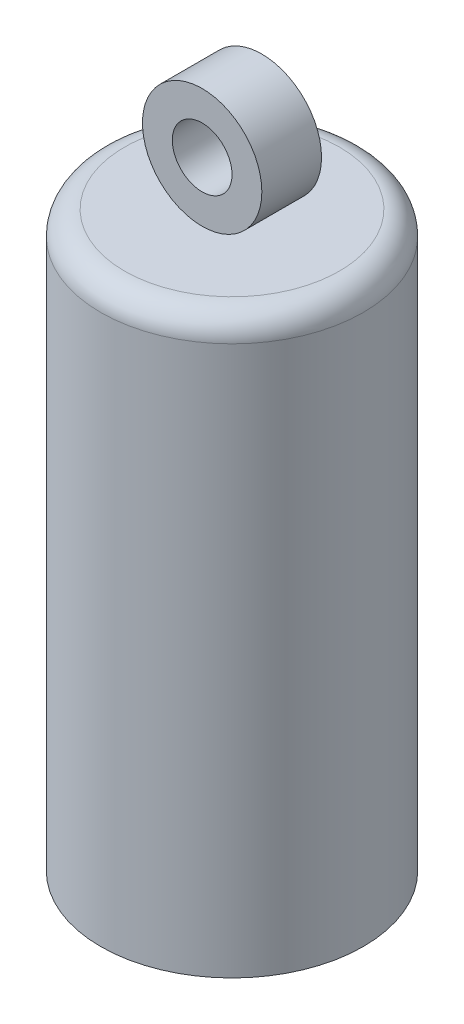
ISO-10303-21;
HEADER;
FILE_DESCRIPTION(('STEP AP214'),'2;1');
FILE_NAME('part.step','',(''),(''),'','','');
FILE_SCHEMA(('AUTOMOTIVE_DESIGN { 1 0 10303 214 1 1 1 1 }'));
ENDSEC;
DATA;
#1=APPLICATION_CONTEXT('core data for automotive mechanical design processes');
#2=APPLICATION_PROTOCOL_DEFINITION('international standard','automotive_design',2000,#1);
#3=PRODUCT_CONTEXT('',#1,'mechanical');
#4=PRODUCT('Part','Part','',(#3));
#5=PRODUCT_RELATED_PRODUCT_CATEGORY('part','',(#4));
#6=PRODUCT_DEFINITION_FORMATION('','',#4);
#7=PRODUCT_DEFINITION_CONTEXT('part definition',#1,'design');
#8=PRODUCT_DEFINITION('design','',#6,#7);
#9=PRODUCT_DEFINITION_SHAPE('','',#8);
#10=(LENGTH_UNIT() NAMED_UNIT(*) SI_UNIT(.MILLI.,.METRE.));
#11=(NAMED_UNIT(*) PLANE_ANGLE_UNIT() SI_UNIT($,.RADIAN.));
#12=(NAMED_UNIT(*) SI_UNIT($,.STERADIAN.) SOLID_ANGLE_UNIT());
#13=UNCERTAINTY_MEASURE_WITH_UNIT(LENGTH_MEASURE(1.E-05),#10,'distance_accuracy_value','');
#14=(GEOMETRIC_REPRESENTATION_CONTEXT(3) GLOBAL_UNCERTAINTY_ASSIGNED_CONTEXT((#13)) GLOBAL_UNIT_ASSIGNED_CONTEXT((#10,
#11,#12)) REPRESENTATION_CONTEXT('',''));
#15=CARTESIAN_POINT('',(0.,0.,0.));
#16=DIRECTION('',(0.,0.,1.));
#17=DIRECTION('',(1.,0.,0.));
#18=AXIS2_PLACEMENT_3D('',#15,#16,#17);
#19=CARTESIAN_POINT('',(0.,4.,1.25));
#20=DIRECTION('',(0.,0.,1.));
#21=DIRECTION('',(1.,0.,0.));
#22=AXIS2_PLACEMENT_3D('',#19,#20,#21);
#23=PLANE('',#22);
#24=CARTESIAN_POINT('',(0.,4.,1.25));
#25=DIRECTION('',(0.,0.,1.));
#26=DIRECTION('',(1.,0.,0.));
#27=AXIS2_PLACEMENT_3D('',#24,#25,#26);
#28=CIRCLE('',#27,2.5);
#29=CARTESIAN_POINT('',(2.5,4.,1.25));
#30=VERTEX_POINT('',#29);
#31=EDGE_CURVE('E11',#30,#30,#28,.T.);
#32=ORIENTED_EDGE('',*,*,#31,.T.);
#33=EDGE_LOOP('',(#32));
#34=FACE_BOUND('',#33,.T.);
#35=CARTESIAN_POINT('',(0.,4.,1.25));
#36=DIRECTION('',(0.,0.,1.));
#37=DIRECTION('',(1.,0.,0.));
#38=AXIS2_PLACEMENT_3D('',#35,#36,#37);
#39=CIRCLE('',#38,1.25);
#40=CARTESIAN_POINT('',(1.25,4.,1.25));
#41=VERTEX_POINT('',#40);
#42=EDGE_CURVE('E51',#41,#41,#39,.T.);
#43=ORIENTED_EDGE('',*,*,#42,.F.);
#44=EDGE_LOOP('',(#43));
#45=FACE_BOUND('',#44,.T.);
#46=ADVANCED_FACE('F40',(#34,#45),#23,.T.);
#47=CARTESIAN_POINT('',(0.,4.,-1.25));
#48=DIRECTION('',(0.,0.,1.));
#49=DIRECTION('',(1.,0.,0.));
#50=AXIS2_PLACEMENT_3D('',#47,#48,#49);
#51=PLANE('',#50);
#52=CARTESIAN_POINT('',(0.,4.,-1.25));
#53=DIRECTION('',(0.,0.,1.));
#54=DIRECTION('',(1.,0.,0.));
#55=AXIS2_PLACEMENT_3D('',#52,#53,#54);
#56=CIRCLE('',#55,2.5);
#57=CARTESIAN_POINT('',(2.5,4.,-1.25));
#58=VERTEX_POINT('',#57);
#59=EDGE_CURVE('E44',#58,#58,#56,.T.);
#60=ORIENTED_EDGE('',*,*,#59,.F.);
#61=EDGE_LOOP('',(#60));
#62=FACE_BOUND('',#61,.T.);
#63=CARTESIAN_POINT('',(0.,4.,-1.25));
#64=DIRECTION('',(0.,0.,1.));
#65=DIRECTION('',(1.,0.,0.));
#66=AXIS2_PLACEMENT_3D('',#63,#64,#65);
#67=CIRCLE('',#66,1.25);
#68=CARTESIAN_POINT('',(1.25,4.,-1.25));
#69=VERTEX_POINT('',#68);
#70=EDGE_CURVE('E53',#69,#69,#67,.T.);
#71=ORIENTED_EDGE('',*,*,#70,.T.);
#72=EDGE_LOOP('',(#71));
#73=FACE_BOUND('',#72,.T.);
#74=ADVANCED_FACE('F63',(#62,#73),#51,.F.);
#75=CARTESIAN_POINT('',(0.,4.,1.25));
#76=DIRECTION('',(0.,0.,-1.));
#77=DIRECTION('',(-1.,0.,0.));
#78=AXIS2_PLACEMENT_3D('',#75,#76,#77);
#79=CYLINDRICAL_SURFACE('',#78,2.5);
#80=ORIENTED_EDGE('',*,*,#31,.F.);
#81=EDGE_LOOP('',(#80));
#82=FACE_BOUND('',#81,.T.);
#83=ORIENTED_EDGE('',*,*,#59,.T.);
#84=EDGE_LOOP('',(#83));
#85=FACE_BOUND('',#84,.T.);
#86=ADVANCED_FACE('F42',(#82,#85),#79,.T.);
#87=CARTESIAN_POINT('',(0.,4.,1.25));
#88=DIRECTION('',(0.,0.,-1.));
#89=DIRECTION('',(-1.,0.,0.));
#90=AXIS2_PLACEMENT_3D('',#87,#88,#89);
#91=CYLINDRICAL_SURFACE('',#90,1.25);
#92=ORIENTED_EDGE('',*,*,#42,.T.);
#93=EDGE_LOOP('',(#92));
#94=FACE_BOUND('',#93,.T.);
#95=ORIENTED_EDGE('',*,*,#70,.F.);
#96=EDGE_LOOP('',(#95));
#97=FACE_BOUND('',#96,.T.);
#98=ADVANCED_FACE('F59',(#94,#97),#91,.F.);
#99=CLOSED_SHELL('',(#46,#74,#86,#98));
#100=MANIFOLD_SOLID_BREP('B2',#99);
#101=CARTESIAN_POINT('',(0.,1.5,0.));
#102=DIRECTION('',(0.,-1.,0.));
#103=DIRECTION('',(0.,0.,-1.));
#104=AXIS2_PLACEMENT_3D('',#101,#102,#103);
#105=CYLINDRICAL_SURFACE('',#104,5.5);
#106=CARTESIAN_POINT('',(0.,0.5,0.));
#107=DIRECTION('',(0.,1.,0.));
#108=DIRECTION('',(0.,0.,1.));
#109=AXIS2_PLACEMENT_3D('',#106,#107,#108);
#110=CIRCLE('',#109,5.5);
#111=CARTESIAN_POINT('',(0.,0.5,5.5));
#112=VERTEX_POINT('',#111);
#113=EDGE_CURVE('E108',#112,#112,#110,.F.);
#114=ORIENTED_EDGE('',*,*,#113,.T.);
#115=EDGE_LOOP('',(#114));
#116=FACE_BOUND('',#115,.T.);
#117=CARTESIAN_POINT('',(0.,-22.5,0.));
#118=DIRECTION('',(0.,-1.,0.));
#119=DIRECTION('',(0.,0.,-1.));
#120=AXIS2_PLACEMENT_3D('',#117,#118,#119);
#121=CIRCLE('',#120,5.5);
#122=CARTESIAN_POINT('',(0.,-22.5,-5.5));
#123=VERTEX_POINT('',#122);
#124=EDGE_CURVE('E116',#123,#123,#121,.T.);
#125=ORIENTED_EDGE('',*,*,#124,.F.);
#126=EDGE_LOOP('',(#125));
#127=FACE_BOUND('',#126,.T.);
#128=ADVANCED_FACE('F101',(#116,#127),#105,.T.);
#129=CARTESIAN_POINT('',(0.,1.5,0.));
#130=DIRECTION('',(0.,1.,0.));
#131=DIRECTION('',(0.,0.,1.));
#132=AXIS2_PLACEMENT_3D('',#129,#130,#131);
#133=PLANE('',#132);
#134=CARTESIAN_POINT('',(0.,1.5,0.));
#135=DIRECTION('',(0.,1.,0.));
#136=DIRECTION('',(0.,0.,1.));
#137=AXIS2_PLACEMENT_3D('',#134,#135,#136);
#138=CIRCLE('',#137,4.5);
#139=CARTESIAN_POINT('',(0.,1.5,4.5));
#140=VERTEX_POINT('',#139);
#141=EDGE_CURVE('E112',#140,#140,#138,.T.);
#142=ORIENTED_EDGE('',*,*,#141,.T.);
#143=EDGE_LOOP('',(#142));
#144=FACE_BOUND('',#143,.T.);
#145=ADVANCED_FACE('F158',(#144),#133,.T.);
#146=CARTESIAN_POINT('',(0.,0.5,0.));
#147=DIRECTION('',(0.,1.,0.));
#148=DIRECTION('',(0.,0.,1.));
#149=AXIS2_PLACEMENT_3D('',#146,#147,#148);
#150=TOROIDAL_SURFACE('',#149,4.5,1.);
#151=ORIENTED_EDGE('',*,*,#113,.F.);
#152=EDGE_LOOP('',(#151));
#153=FACE_BOUND('',#152,.T.);
#154=ORIENTED_EDGE('',*,*,#141,.F.);
#155=EDGE_LOOP('',(#154));
#156=FACE_BOUND('',#155,.T.);
#157=ADVANCED_FACE('F103',(#153,#156),#150,.T.);
#158=CARTESIAN_POINT('',(0.,-22.5,0.));
#159=DIRECTION('',(0.,-1.,0.));
#160=DIRECTION('',(0.,0.,-1.));
#161=AXIS2_PLACEMENT_3D('',#158,#159,#160);
#162=PLANE('',#161);
#163=ORIENTED_EDGE('',*,*,#124,.T.);
#164=EDGE_LOOP('',(#163));
#165=FACE_BOUND('',#164,.T.);
#166=CARTESIAN_POINT('',(0.,-22.5,0.));
#167=DIRECTION('',(0.,-1.,0.));
#168=DIRECTION('',(0.,0.,-1.));
#169=AXIS2_PLACEMENT_3D('',#166,#167,#168);
#170=CIRCLE('',#169,5.35);
#171=CARTESIAN_POINT('',(0.,-22.5,-5.35));
#172=VERTEX_POINT('',#171);
#173=EDGE_CURVE('E121',#172,#172,#170,.T.);
#174=ORIENTED_EDGE('',*,*,#173,.F.);
#175=EDGE_LOOP('',(#174));
#176=FACE_BOUND('',#175,.T.);
#177=ADVANCED_FACE('F166',(#165,#176),#162,.T.);
#178=CARTESIAN_POINT('',(0.,-22.5,0.));
#179=DIRECTION('',(0.,1.,0.));
#180=DIRECTION('',(0.,0.,1.));
#181=AXIS2_PLACEMENT_3D('',#178,#179,#180);
#182=CYLINDRICAL_SURFACE('',#181,5.35);
#183=ORIENTED_EDGE('',*,*,#173,.T.);
#184=EDGE_LOOP('',(#183));
#185=FACE_BOUND('',#184,.T.);
#186=CARTESIAN_POINT('',(0.,0.,0.));
#187=DIRECTION('',(0.,-1.,0.));
#188=DIRECTION('',(0.,0.,-1.));
#189=AXIS2_PLACEMENT_3D('',#186,#187,#188);
#190=CIRCLE('',#189,5.35);
#191=CARTESIAN_POINT('',(0.,0.,-5.35));
#192=VERTEX_POINT('',#191);
#193=EDGE_CURVE('E122',#192,#192,#190,.T.);
#194=ORIENTED_EDGE('',*,*,#193,.F.);
#195=EDGE_LOOP('',(#194));
#196=FACE_BOUND('',#195,.T.);
#197=ADVANCED_FACE('F152',(#185,#196),#182,.F.);
#198=CARTESIAN_POINT('',(0.,0.,0.));
#199=DIRECTION('',(0.,1.,0.));
#200=DIRECTION('',(0.,0.,1.));
#201=AXIS2_PLACEMENT_3D('',#198,#199,#200);
#202=PLANE('',#201);
#203=CARTESIAN_POINT('',(0.,0.,0.));
#204=DIRECTION('',(0.,1.,0.));
#205=DIRECTION('',(0.,0.,1.));
#206=AXIS2_PLACEMENT_3D('',#203,#204,#205);
#207=CIRCLE('',#206,2.75);
#208=CARTESIAN_POINT('',(0.,0.,2.75));
#209=VERTEX_POINT('',#208);
#210=EDGE_CURVE('E39',#209,#209,#207,.F.);
#211=ORIENTED_EDGE('',*,*,#210,.F.);
#212=EDGE_LOOP('',(#211));
#213=FACE_BOUND('',#212,.T.);
#214=ORIENTED_EDGE('',*,*,#193,.T.);
#215=EDGE_LOOP('',(#214));
#216=FACE_BOUND('',#215,.T.);
#217=ADVANCED_FACE('F143',(#213,#216),#202,.F.);
#218=CARTESIAN_POINT('',(0.,-22.5,0.));
#219=DIRECTION('',(0.,-1.,0.));
#220=DIRECTION('',(0.,0.,-1.));
#221=AXIS2_PLACEMENT_3D('',#218,#219,#220);
#222=PLANE('',#221);
#223=CARTESIAN_POINT('',(0.,-22.5,0.));
#224=DIRECTION('',(0.,-1.,0.));
#225=DIRECTION('',(0.,0.,-1.));
#226=AXIS2_PLACEMENT_3D('',#223,#224,#225);
#227=CIRCLE('',#226,2.75);
#228=CARTESIAN_POINT('',(0.,-22.5,-2.75));
#229=VERTEX_POINT('',#228);
#230=EDGE_CURVE('E125',#229,#229,#227,.T.);
#231=ORIENTED_EDGE('',*,*,#230,.T.);
#232=EDGE_LOOP('',(#231));
#233=FACE_BOUND('',#232,.T.);
#234=CARTESIAN_POINT('',(0.,-22.5,0.));
#235=DIRECTION('',(0.,-1.,0.));
#236=DIRECTION('',(0.,0.,-1.));
#237=AXIS2_PLACEMENT_3D('',#234,#235,#236);
#238=CIRCLE('',#237,2.6);
#239=CARTESIAN_POINT('',(0.,-22.5,-2.6));
#240=VERTEX_POINT('',#239);
#241=EDGE_CURVE('E130',#240,#240,#238,.T.);
#242=ORIENTED_EDGE('',*,*,#241,.F.);
#243=EDGE_LOOP('',(#242));
#244=FACE_BOUND('',#243,.T.);
#245=ADVANCED_FACE('F140',(#233,#244),#222,.T.);
#246=CARTESIAN_POINT('',(0.,-22.5,0.));
#247=DIRECTION('',(0.,1.,0.));
#248=DIRECTION('',(0.,0.,1.));
#249=AXIS2_PLACEMENT_3D('',#246,#247,#248);
#250=CYLINDRICAL_SURFACE('',#249,2.75);
#251=ORIENTED_EDGE('',*,*,#230,.F.);
#252=EDGE_LOOP('',(#251));
#253=FACE_BOUND('',#252,.T.);
#254=ORIENTED_EDGE('',*,*,#210,.T.);
#255=EDGE_LOOP('',(#254));
#256=FACE_BOUND('',#255,.T.);
#257=ADVANCED_FACE('F142',(#253,#256),#250,.T.);
#258=CARTESIAN_POINT('',(0.,-22.5,0.));
#259=DIRECTION('',(0.,1.,0.));
#260=DIRECTION('',(0.,0.,1.));
#261=AXIS2_PLACEMENT_3D('',#258,#259,#260);
#262=CYLINDRICAL_SURFACE('',#261,2.6);
#263=ORIENTED_EDGE('',*,*,#241,.T.);
#264=EDGE_LOOP('',(#263));
#265=FACE_BOUND('',#264,.T.);
#266=CARTESIAN_POINT('',(0.,0.,0.));
#267=DIRECTION('',(0.,-1.,0.));
#268=DIRECTION('',(0.,0.,-1.));
#269=AXIS2_PLACEMENT_3D('',#266,#267,#268);
#270=CIRCLE('',#269,2.6);
#271=CARTESIAN_POINT('',(0.,0.,-2.6));
#272=VERTEX_POINT('',#271);
#273=EDGE_CURVE('E131',#272,#272,#270,.T.);
#274=ORIENTED_EDGE('',*,*,#273,.F.);
#275=EDGE_LOOP('',(#274));
#276=FACE_BOUND('',#275,.T.);
#277=ADVANCED_FACE('F137',(#265,#276),#262,.F.);
#278=ORIENTED_EDGE('',*,*,#273,.T.);
#279=EDGE_LOOP('',(#278));
#280=FACE_BOUND('',#279,.T.);
#281=ADVANCED_FACE('F155',(#280),#202,.F.);
#282=CLOSED_SHELL('',(#128,#145,#157,#177,#197,#217,#245,#257,#277,#281));
#283=MANIFOLD_SOLID_BREP('B6',#282);
#284=ADVANCED_BREP_SHAPE_REPRESENTATION('',(#18,#100,#283),#14);
#285=SHAPE_DEFINITION_REPRESENTATION(#9,#284);
ENDSEC;
END-ISO-10303-21;
